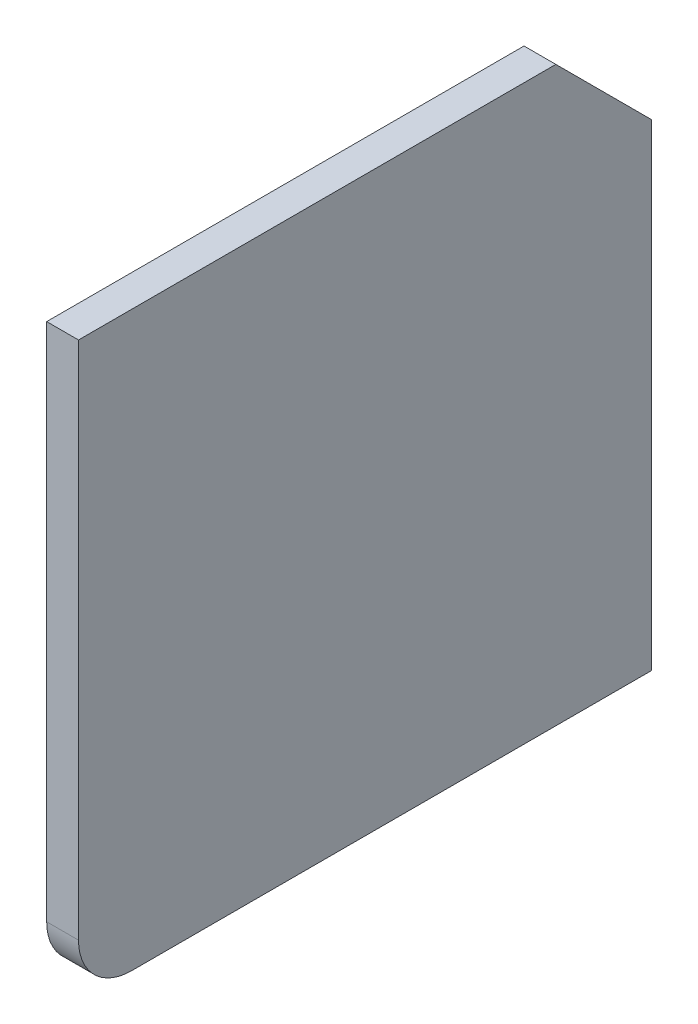
ISO-10303-21;
HEADER;
FILE_DESCRIPTION(('STEP AP214'),'2;1');
FILE_NAME('part.step','',(''),(''),'','','');
FILE_SCHEMA(('AUTOMOTIVE_DESIGN { 1 0 10303 214 1 1 1 1 }'));
ENDSEC;
DATA;
#1=APPLICATION_CONTEXT('core data for automotive mechanical design processes');
#2=APPLICATION_PROTOCOL_DEFINITION('international standard','automotive_design',2000,#1);
#3=PRODUCT_CONTEXT('',#1,'mechanical');
#4=PRODUCT('Part','Part','',(#3));
#5=PRODUCT_RELATED_PRODUCT_CATEGORY('part','',(#4));
#6=PRODUCT_DEFINITION_FORMATION('','',#4);
#7=PRODUCT_DEFINITION_CONTEXT('part definition',#1,'design');
#8=PRODUCT_DEFINITION('design','',#6,#7);
#9=PRODUCT_DEFINITION_SHAPE('','',#8);
#10=(LENGTH_UNIT() NAMED_UNIT(*) SI_UNIT(.MILLI.,.METRE.));
#11=(NAMED_UNIT(*) PLANE_ANGLE_UNIT() SI_UNIT($,.RADIAN.));
#12=(NAMED_UNIT(*) SI_UNIT($,.STERADIAN.) SOLID_ANGLE_UNIT());
#13=UNCERTAINTY_MEASURE_WITH_UNIT(LENGTH_MEASURE(1.E-05),#10,'distance_accuracy_value','');
#14=(GEOMETRIC_REPRESENTATION_CONTEXT(3) GLOBAL_UNCERTAINTY_ASSIGNED_CONTEXT((#13)) GLOBAL_UNIT_ASSIGNED_CONTEXT((#10,
#11,#12)) REPRESENTATION_CONTEXT('',''));
#15=CARTESIAN_POINT('',(0.,0.,0.));
#16=DIRECTION('',(0.,0.,1.));
#17=DIRECTION('',(1.,0.,0.));
#18=AXIS2_PLACEMENT_3D('',#15,#16,#17);
#19=CARTESIAN_POINT('',(546.999999999999,-5.99999999999978,-735.));
#20=DIRECTION('',(0.,0.,1.));
#21=DIRECTION('',(0.,-1.,0.));
#22=AXIS2_PLACEMENT_3D('',#19,#20,#21);
#23=PLANE('',#22);
#24=DIRECTION('',(0.,-1.,0.));
#25=VECTOR('',#24,1.);
#26=CARTESIAN_POINT('',(546.999999999999,-5.99999999999978,-735.));
#27=LINE('',#26,#25);
#28=CARTESIAN_POINT('',(546.999999999999,-5.99999999999978,-735.));
#29=VERTEX_POINT('',#28);
#30=CARTESIAN_POINT('',(546.999999999999,-54.9999999999995,-735.));
#31=VERTEX_POINT('',#30);
#32=EDGE_CURVE('E94',#29,#31,#27,.T.);
#33=ORIENTED_EDGE('',*,*,#32,.T.);
#34=DIRECTION('',(1.,0.,0.));
#35=VECTOR('',#34,1.);
#36=CARTESIAN_POINT('',(546.999999999999,-54.9999999999995,-735.));
#37=LINE('',#36,#35);
#38=CARTESIAN_POINT('',(549.999999999999,-54.9999999999995,-735.));
#39=VERTEX_POINT('',#38);
#40=EDGE_CURVE('E128',#31,#39,#37,.T.);
#41=ORIENTED_EDGE('',*,*,#40,.T.);
#42=DIRECTION('',(0.,-1.,0.));
#43=VECTOR('',#42,1.);
#44=CARTESIAN_POINT('',(549.999999999999,-5.99999999999978,-735.));
#45=LINE('',#44,#43);
#46=CARTESIAN_POINT('',(549.999999999999,-5.99999999999978,-735.));
#47=VERTEX_POINT('',#46);
#48=EDGE_CURVE('E115',#47,#39,#45,.T.);
#49=ORIENTED_EDGE('',*,*,#48,.F.);
#50=DIRECTION('',(1.,0.,0.));
#51=VECTOR('',#50,1.);
#52=CARTESIAN_POINT('',(546.999999999999,-5.99999999999978,-735.));
#53=LINE('',#52,#51);
#54=EDGE_CURVE('E126',#29,#47,#53,.T.);
#55=ORIENTED_EDGE('',*,*,#54,.F.);
#56=EDGE_LOOP('',(#33,#41,#49,#55));
#57=FACE_BOUND('',#56,.T.);
#58=ADVANCED_FACE('F36',(#57),#23,.T.);
#59=CARTESIAN_POINT('',(546.999999999999,-5.99999999999978,-735.));
#60=DIRECTION('',(0.,1.,0.));
#61=DIRECTION('',(0.,0.,1.));
#62=AXIS2_PLACEMENT_3D('',#59,#60,#61);
#63=PLANE('',#62);
#64=DIRECTION('',(0.,0.,1.));
#65=VECTOR('',#64,1.);
#66=CARTESIAN_POINT('',(549.999999999999,-5.99999999999978,-735.));
#67=LINE('',#66,#65);
#68=CARTESIAN_POINT('',(549.999999999999,-6.00000000000001,-780.));
#69=VERTEX_POINT('',#68);
#70=EDGE_CURVE('E123',#69,#47,#67,.T.);
#71=ORIENTED_EDGE('',*,*,#70,.F.);
#72=DIRECTION('',(1.,0.,0.));
#73=VECTOR('',#72,1.);
#74=CARTESIAN_POINT('',(546.999999999999,-6.00000000000001,-780.));
#75=LINE('',#74,#73);
#76=CARTESIAN_POINT('',(546.999999999999,-6.00000000000001,-780.));
#77=VERTEX_POINT('',#76);
#78=EDGE_CURVE('E129',#77,#69,#75,.T.);
#79=ORIENTED_EDGE('',*,*,#78,.F.);
#80=DIRECTION('',(0.,0.,1.));
#81=VECTOR('',#80,1.);
#82=CARTESIAN_POINT('',(546.999999999999,-5.99999999999978,-735.));
#83=LINE('',#82,#81);
#84=EDGE_CURVE('E102',#77,#29,#83,.T.);
#85=ORIENTED_EDGE('',*,*,#84,.T.);
#86=ORIENTED_EDGE('',*,*,#54,.T.);
#87=EDGE_LOOP('',(#71,#79,#85,#86));
#88=FACE_BOUND('',#87,.T.);
#89=ADVANCED_FACE('F144',(#88),#63,.T.);
#90=CARTESIAN_POINT('',(546.999999999999,-6.00000000000001,-780.));
#91=DIRECTION('',(0.,0.707106781186534,-0.707106781186561));
#92=DIRECTION('',(0.,0.707106781186561,0.707106781186534));
#93=AXIS2_PLACEMENT_3D('',#90,#91,#92);
#94=PLANE('',#93);
#95=DIRECTION('',(0.,0.707106781186561,0.707106781186534));
#96=VECTOR('',#95,1.);
#97=CARTESIAN_POINT('',(549.999999999999,-6.00000000000001,-780.));
#98=LINE('',#97,#96);
#99=CARTESIAN_POINT('',(549.999999999999,-14.9999999999999,-789.));
#100=VERTEX_POINT('',#99);
#101=EDGE_CURVE('E120',#100,#69,#98,.T.);
#102=ORIENTED_EDGE('',*,*,#101,.F.);
#103=DIRECTION('',(1.,0.,0.));
#104=VECTOR('',#103,1.);
#105=CARTESIAN_POINT('',(546.999999999999,-14.9999999999999,-789.));
#106=LINE('',#105,#104);
#107=CARTESIAN_POINT('',(546.999999999999,-14.9999999999999,-789.));
#108=VERTEX_POINT('',#107);
#109=EDGE_CURVE('E101',#108,#100,#106,.T.);
#110=ORIENTED_EDGE('',*,*,#109,.F.);
#111=DIRECTION('',(0.,0.707106781186561,0.707106781186534));
#112=VECTOR('',#111,1.);
#113=CARTESIAN_POINT('',(546.999999999999,-6.00000000000001,-780.));
#114=LINE('',#113,#112);
#115=EDGE_CURVE('E108',#108,#77,#114,.T.);
#116=ORIENTED_EDGE('',*,*,#115,.T.);
#117=ORIENTED_EDGE('',*,*,#78,.T.);
#118=EDGE_LOOP('',(#102,#110,#116,#117));
#119=FACE_BOUND('',#118,.T.);
#120=ADVANCED_FACE('F154',(#119),#94,.T.);
#121=CARTESIAN_POINT('',(546.999999999999,-14.9999999999999,-789.));
#122=DIRECTION('',(0.,0.,-1.));
#123=DIRECTION('',(0.,1.,0.));
#124=AXIS2_PLACEMENT_3D('',#121,#122,#123);
#125=PLANE('',#124);
#126=DIRECTION('',(0.,1.,0.));
#127=VECTOR('',#126,1.);
#128=CARTESIAN_POINT('',(549.999999999999,-14.9999999999999,-789.));
#129=LINE('',#128,#127);
#130=CARTESIAN_POINT('',(549.999999999999,-59.9999999999994,-789.));
#131=VERTEX_POINT('',#130);
#132=EDGE_CURVE('E100',#131,#100,#129,.T.);
#133=ORIENTED_EDGE('',*,*,#132,.F.);
#134=DIRECTION('',(1.,0.,0.));
#135=VECTOR('',#134,1.);
#136=CARTESIAN_POINT('',(546.999999999999,-59.9999999999994,-789.));
#137=LINE('',#136,#135);
#138=CARTESIAN_POINT('',(546.999999999999,-59.9999999999994,-789.));
#139=VERTEX_POINT('',#138);
#140=EDGE_CURVE('E88',#139,#131,#137,.T.);
#141=ORIENTED_EDGE('',*,*,#140,.F.);
#142=DIRECTION('',(0.,1.,0.));
#143=VECTOR('',#142,1.);
#144=CARTESIAN_POINT('',(546.999999999999,-14.9999999999999,-789.));
#145=LINE('',#144,#143);
#146=EDGE_CURVE('E93',#139,#108,#145,.T.);
#147=ORIENTED_EDGE('',*,*,#146,.T.);
#148=ORIENTED_EDGE('',*,*,#109,.T.);
#149=EDGE_LOOP('',(#133,#141,#147,#148));
#150=FACE_BOUND('',#149,.T.);
#151=ADVANCED_FACE('F98',(#150),#125,.T.);
#152=CARTESIAN_POINT('',(546.999999999999,-59.9999999999996,-735.));
#153=DIRECTION('',(0.,-1.,0.));
#154=DIRECTION('',(0.,0.,-1.));
#155=AXIS2_PLACEMENT_3D('',#152,#153,#154);
#156=PLANE('',#155);
#157=DIRECTION('',(0.,0.,-1.));
#158=VECTOR('',#157,1.);
#159=CARTESIAN_POINT('',(549.999999999999,-59.9999999999996,-735.));
#160=LINE('',#159,#158);
#161=CARTESIAN_POINT('',(549.999999999999,-59.9999999999996,-740.));
#162=VERTEX_POINT('',#161);
#163=EDGE_CURVE('E117',#162,#131,#160,.T.);
#164=ORIENTED_EDGE('',*,*,#163,.F.);
#165=DIRECTION('',(1.,0.,0.));
#166=VECTOR('',#165,1.);
#167=CARTESIAN_POINT('',(546.999999999999,-59.9999999999996,-740.));
#168=LINE('',#167,#166);
#169=CARTESIAN_POINT('',(546.999999999999,-59.9999999999996,-740.));
#170=VERTEX_POINT('',#169);
#171=EDGE_CURVE('E44',#162,#170,#168,.F.);
#172=ORIENTED_EDGE('',*,*,#171,.T.);
#173=DIRECTION('',(0.,0.,-1.));
#174=VECTOR('',#173,1.);
#175=CARTESIAN_POINT('',(546.999999999999,-59.9999999999996,-735.));
#176=LINE('',#175,#174);
#177=EDGE_CURVE('E85',#170,#139,#176,.T.);
#178=ORIENTED_EDGE('',*,*,#177,.T.);
#179=ORIENTED_EDGE('',*,*,#140,.T.);
#180=EDGE_LOOP('',(#164,#172,#178,#179));
#181=FACE_BOUND('',#180,.T.);
#182=ADVANCED_FACE('F87',(#181),#156,.T.);
#183=CARTESIAN_POINT('',(546.999999999999,0.,3.33066907387547E-13));
#184=DIRECTION('',(1.,0.,0.));
#185=DIRECTION('',(0.,0.,-1.));
#186=AXIS2_PLACEMENT_3D('',#183,#184,#185);
#187=PLANE('',#186);
#188=ORIENTED_EDGE('',*,*,#177,.F.);
#189=CARTESIAN_POINT('',(546.999999999999,-54.9999999999995,-740.));
#190=DIRECTION('',(1.,0.,0.));
#191=DIRECTION('',(0.,0.,-1.));
#192=AXIS2_PLACEMENT_3D('',#189,#190,#191);
#193=CIRCLE('',#192,5.);
#194=EDGE_CURVE('E11',#170,#31,#193,.F.);
#195=ORIENTED_EDGE('',*,*,#194,.T.);
#196=ORIENTED_EDGE('',*,*,#32,.F.);
#197=ORIENTED_EDGE('',*,*,#84,.F.);
#198=ORIENTED_EDGE('',*,*,#115,.F.);
#199=ORIENTED_EDGE('',*,*,#146,.F.);
#200=EDGE_LOOP('',(#188,#195,#196,#197,#198,#199));
#201=FACE_BOUND('',#200,.T.);
#202=ADVANCED_FACE('F105',(#201),#187,.F.);
#203=CARTESIAN_POINT('',(550.,0.,3.33066907387547E-13));
#204=DIRECTION('',(1.,0.,0.));
#205=DIRECTION('',(0.,0.,-1.));
#206=AXIS2_PLACEMENT_3D('',#203,#204,#205);
#207=PLANE('',#206);
#208=ORIENTED_EDGE('',*,*,#48,.T.);
#209=CARTESIAN_POINT('',(549.999999999999,-54.9999999999995,-740.));
#210=DIRECTION('',(1.,0.,0.));
#211=DIRECTION('',(0.,0.,-1.));
#212=AXIS2_PLACEMENT_3D('',#209,#210,#211);
#213=CIRCLE('',#212,5.);
#214=EDGE_CURVE('E58',#39,#162,#213,.T.);
#215=ORIENTED_EDGE('',*,*,#214,.T.);
#216=ORIENTED_EDGE('',*,*,#163,.T.);
#217=ORIENTED_EDGE('',*,*,#132,.T.);
#218=ORIENTED_EDGE('',*,*,#101,.T.);
#219=ORIENTED_EDGE('',*,*,#70,.T.);
#220=EDGE_LOOP('',(#208,#215,#216,#217,#218,#219));
#221=FACE_BOUND('',#220,.T.);
#222=ADVANCED_FACE('F140',(#221),#207,.T.);
#223=CARTESIAN_POINT('',(546.999999999999,-54.9999999999995,-740.));
#224=DIRECTION('',(1.,0.,0.));
#225=DIRECTION('',(0.,0.,-1.));
#226=AXIS2_PLACEMENT_3D('',#223,#224,#225);
#227=CYLINDRICAL_SURFACE('',#226,5.);
#228=ORIENTED_EDGE('',*,*,#194,.F.);
#229=ORIENTED_EDGE('',*,*,#171,.F.);
#230=ORIENTED_EDGE('',*,*,#214,.F.);
#231=ORIENTED_EDGE('',*,*,#40,.F.);
#232=EDGE_LOOP('',(#228,#229,#230,#231));
#233=FACE_BOUND('',#232,.T.);
#234=ADVANCED_FACE('F38',(#233),#227,.T.);
#235=CLOSED_SHELL('',(#58,#89,#120,#151,#182,#202,#222,#234));
#236=MANIFOLD_SOLID_BREP('B2',#235);
#237=ADVANCED_BREP_SHAPE_REPRESENTATION('',(#18,#236),#14);
#238=SHAPE_DEFINITION_REPRESENTATION(#9,#237);
ENDSEC;
END-ISO-10303-21;
